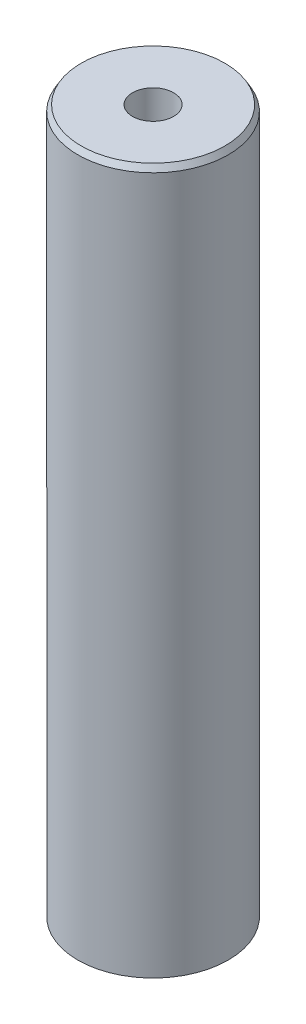
ISO-10303-21;
HEADER;
FILE_DESCRIPTION(('STEP AP214'),'2;1');
FILE_NAME('part.step','',(''),(''),'','','');
FILE_SCHEMA(('AUTOMOTIVE_DESIGN { 1 0 10303 214 1 1 1 1 }'));
ENDSEC;
DATA;
#1=APPLICATION_CONTEXT('core data for automotive mechanical design processes');
#2=APPLICATION_PROTOCOL_DEFINITION('international standard','automotive_design',2000,#1);
#3=PRODUCT_CONTEXT('',#1,'mechanical');
#4=PRODUCT('Part','Part','',(#3));
#5=PRODUCT_RELATED_PRODUCT_CATEGORY('part','',(#4));
#6=PRODUCT_DEFINITION_FORMATION('','',#4);
#7=PRODUCT_DEFINITION_CONTEXT('part definition',#1,'design');
#8=PRODUCT_DEFINITION('design','',#6,#7);
#9=PRODUCT_DEFINITION_SHAPE('','',#8);
#10=(LENGTH_UNIT() NAMED_UNIT(*) SI_UNIT(.MILLI.,.METRE.));
#11=(NAMED_UNIT(*) PLANE_ANGLE_UNIT() SI_UNIT($,.RADIAN.));
#12=(NAMED_UNIT(*) SI_UNIT($,.STERADIAN.) SOLID_ANGLE_UNIT());
#13=UNCERTAINTY_MEASURE_WITH_UNIT(LENGTH_MEASURE(1.E-05),#10,'distance_accuracy_value','');
#14=(GEOMETRIC_REPRESENTATION_CONTEXT(3) GLOBAL_UNCERTAINTY_ASSIGNED_CONTEXT((#13)) GLOBAL_UNIT_ASSIGNED_CONTEXT((#10,
#11,#12)) REPRESENTATION_CONTEXT('',''));
#15=CARTESIAN_POINT('',(0.,0.,0.));
#16=DIRECTION('',(0.,0.,1.));
#17=DIRECTION('',(1.,0.,0.));
#18=AXIS2_PLACEMENT_3D('',#15,#16,#17);
#19=CARTESIAN_POINT('',(0.,164.39141021233,0.));
#20=DIRECTION('',(0.,-1.,0.));
#21=DIRECTION('',(0.,0.,-1.));
#22=AXIS2_PLACEMENT_3D('',#19,#20,#21);
#23=CYLINDRICAL_SURFACE('',#22,17.5);
#24=CARTESIAN_POINT('',(0.,163.011313181697,0.));
#25=DIRECTION('',(0.,1.,0.));
#26=DIRECTION('',(0.,0.,1.));
#27=AXIS2_PLACEMENT_3D('',#24,#25,#26);
#28=CIRCLE('',#27,17.5);
#29=CARTESIAN_POINT('',(0.,163.011313181697,-17.5));
#30=VERTEX_POINT('',#29);
#31=EDGE_CURVE('E50',#30,#30,#28,.F.);
#32=ORIENTED_EDGE('',*,*,#31,.T.);
#33=EDGE_LOOP('',(#32));
#34=FACE_BOUND('',#33,.T.);
#35=CARTESIAN_POINT('',(0.,0.796799392143832,0.));
#36=DIRECTION('',(0.,1.,0.));
#37=DIRECTION('',(0.,0.,1.));
#38=AXIS2_PLACEMENT_3D('',#35,#36,#37);
#39=CIRCLE('',#38,17.5);
#40=CARTESIAN_POINT('',(0.,0.796799392143832,17.5));
#41=VERTEX_POINT('',#40);
#42=EDGE_CURVE('E51',#41,#41,#39,.T.);
#43=ORIENTED_EDGE('',*,*,#42,.T.);
#44=EDGE_LOOP('',(#43));
#45=FACE_BOUND('',#44,.T.);
#46=ADVANCED_FACE('F39',(#34,#45),#23,.T.);
#47=CARTESIAN_POINT('',(0.,164.39141021233,0.));
#48=DIRECTION('',(0.,1.,0.));
#49=DIRECTION('',(0.,0.,1.));
#50=AXIS2_PLACEMENT_3D('',#47,#48,#49);
#51=PLANE('',#50);
#52=CARTESIAN_POINT('',(0.,164.39141021233,0.));
#53=DIRECTION('',(0.,1.,0.));
#54=DIRECTION('',(0.,0.,1.));
#55=AXIS2_PLACEMENT_3D('',#52,#53,#54);
#56=CIRCLE('',#55,16.7032006078562);
#57=CARTESIAN_POINT('',(0.,164.39141021233,-16.7032006078562));
#58=VERTEX_POINT('',#57);
#59=EDGE_CURVE('E54',#58,#58,#56,.T.);
#60=ORIENTED_EDGE('',*,*,#59,.T.);
#61=EDGE_LOOP('',(#60));
#62=FACE_BOUND('',#61,.T.);
#63=CARTESIAN_POINT('',(0.,164.39141021233,0.));
#64=DIRECTION('',(0.,1.,0.));
#65=DIRECTION('',(0.,0.,1.));
#66=AXIS2_PLACEMENT_3D('',#63,#64,#65);
#67=CIRCLE('',#66,4.78098301925172);
#68=CARTESIAN_POINT('',(0.,164.39141021233,4.78098301925172));
#69=VERTEX_POINT('',#68);
#70=EDGE_CURVE('E58',#69,#69,#67,.T.);
#71=ORIENTED_EDGE('',*,*,#70,.F.);
#72=EDGE_LOOP('',(#71));
#73=FACE_BOUND('',#72,.T.);
#74=ADVANCED_FACE('F69',(#62,#73),#51,.T.);
#75=CARTESIAN_POINT('',(0.,0.,0.));
#76=DIRECTION('',(0.,1.,0.));
#77=DIRECTION('',(0.,0.,1.));
#78=AXIS2_PLACEMENT_3D('',#75,#76,#77);
#79=PLANE('',#78);
#80=CARTESIAN_POINT('',(0.,0.,0.));
#81=DIRECTION('',(0.,1.,0.));
#82=DIRECTION('',(0.,0.,1.));
#83=AXIS2_PLACEMENT_3D('',#80,#81,#82);
#84=CIRCLE('',#83,16.1199029693669);
#85=CARTESIAN_POINT('',(0.,0.,16.1199029693669));
#86=VERTEX_POINT('',#85);
#87=EDGE_CURVE('E10',#86,#86,#84,.F.);
#88=ORIENTED_EDGE('',*,*,#87,.T.);
#89=EDGE_LOOP('',(#88));
#90=FACE_BOUND('',#89,.T.);
#91=CARTESIAN_POINT('',(0.,0.,0.));
#92=DIRECTION('',(0.,1.,0.));
#93=DIRECTION('',(0.,0.,1.));
#94=AXIS2_PLACEMENT_3D('',#91,#92,#93);
#95=CIRCLE('',#94,4.78098301925172);
#96=CARTESIAN_POINT('',(0.,0.,4.78098301925172));
#97=VERTEX_POINT('',#96);
#98=EDGE_CURVE('E63',#97,#97,#95,.T.);
#99=ORIENTED_EDGE('',*,*,#98,.T.);
#100=EDGE_LOOP('',(#99));
#101=FACE_BOUND('',#100,.T.);
#102=ADVANCED_FACE('F75',(#90,#101),#79,.F.);
#103=CARTESIAN_POINT('',(0.,164.39141021233,0.));
#104=DIRECTION('',(0.,-1.,0.));
#105=DIRECTION('',(0.,0.,-1.));
#106=AXIS2_PLACEMENT_3D('',#103,#104,#105);
#107=CYLINDRICAL_SURFACE('',#106,4.78098301925172);
#108=ORIENTED_EDGE('',*,*,#70,.T.);
#109=EDGE_LOOP('',(#108));
#110=FACE_BOUND('',#109,.T.);
#111=ORIENTED_EDGE('',*,*,#98,.F.);
#112=EDGE_LOOP('',(#111));
#113=FACE_BOUND('',#112,.T.);
#114=ADVANCED_FACE('F70',(#110,#113),#107,.F.);
#115=CARTESIAN_POINT('',(0.,164.39141021233,0.));
#116=DIRECTION('',(0.,-1.,0.));
#117=DIRECTION('',(0.,0.,-1.));
#118=AXIS2_PLACEMENT_3D('',#115,#116,#117);
#119=CONICAL_SURFACE('',#118,16.7032006078562,0.523598775598286);
#120=CARTESIAN_POINT('',(0.,163.011313181697,-17.5));
#121=CARTESIAN_POINT('',(0.,163.025689192433,-17.4917000063318));
#122=CARTESIAN_POINT('',(0.,163.040065203168,-17.4834000126637));
#123=CARTESIAN_POINT('',(0.,163.06881722464,-17.4668000253274));
#124=CARTESIAN_POINT('',(0.,163.083193235376,-17.4585000316592));
#125=CARTESIAN_POINT('',(0.,163.111945256847,-17.4419000443229));
#126=CARTESIAN_POINT('',(0.,163.126321267583,-17.4336000506547));
#127=CARTESIAN_POINT('',(0.,163.155073289055,-17.4170000633184));
#128=CARTESIAN_POINT('',(0.,163.16944929979,-17.4087000696502));
#129=CARTESIAN_POINT('',(0.,163.198201321262,-17.3921000823139));
#130=CARTESIAN_POINT('',(0.,163.212577331998,-17.3838000886457));
#131=CARTESIAN_POINT('',(0.,163.241329353469,-17.3672001013094));
#132=CARTESIAN_POINT('',(0.,163.255705364205,-17.3589001076412));
#133=CARTESIAN_POINT('',(0.,163.284457385676,-17.3423001203049));
#134=CARTESIAN_POINT('',(0.,163.298833396412,-17.3340001266367));
#135=CARTESIAN_POINT('',(0.,163.327585417884,-17.3174001393004));
#136=CARTESIAN_POINT('',(0.,163.341961428619,-17.3091001456322));
#137=CARTESIAN_POINT('',(0.,163.370713450091,-17.2925001582959));
#138=CARTESIAN_POINT('',(0.,163.385089460827,-17.2842001646277));
#139=CARTESIAN_POINT('',(0.,163.413841482298,-17.2676001772914));
#140=CARTESIAN_POINT('',(0.,163.428217493034,-17.2593001836232));
#141=CARTESIAN_POINT('',(0.,163.456969514506,-17.2427001962869));
#142=CARTESIAN_POINT('',(0.,163.471345525241,-17.2344002026187));
#143=CARTESIAN_POINT('',(0.,163.500097546713,-17.2178002152824));
#144=CARTESIAN_POINT('',(0.,163.514473557449,-17.2095002216142));
#145=CARTESIAN_POINT('',(0.,163.54322557892,-17.1929002342779));
#146=CARTESIAN_POINT('',(0.,163.557601589656,-17.1846002406097));
#147=CARTESIAN_POINT('',(0.,163.586353611127,-17.1680002532734));
#148=CARTESIAN_POINT('',(0.,163.600729621863,-17.1597002596052));
#149=CARTESIAN_POINT('',(0.,163.629481643335,-17.1431002722689));
#150=CARTESIAN_POINT('',(0.,163.64385765407,-17.1348002786008));
#151=CARTESIAN_POINT('',(0.,163.672609675542,-17.1182002912644));
#152=CARTESIAN_POINT('',(0.,163.686985686278,-17.1099002975963));
#153=CARTESIAN_POINT('',(0.,163.715737707749,-17.0933003102599));
#154=CARTESIAN_POINT('',(0.,163.730113718485,-17.0850003165918));
#155=CARTESIAN_POINT('',(0.,163.758865739957,-17.0684003292554));
#156=CARTESIAN_POINT('',(0.,163.773241750692,-17.0601003355873));
#157=CARTESIAN_POINT('',(0.,163.801993772164,-17.0435003482509));
#158=CARTESIAN_POINT('',(0.,163.8163697829,-17.0352003545828));
#159=CARTESIAN_POINT('',(0.,163.845121804371,-17.0186003672464));
#160=CARTESIAN_POINT('',(0.,163.859497815107,-17.0103003735783));
#161=CARTESIAN_POINT('',(0.,163.888249836578,-16.9937003862419));
#162=CARTESIAN_POINT('',(0.,163.902625847314,-16.9854003925738));
#163=CARTESIAN_POINT('',(0.,163.931377868786,-16.9688004052374));
#164=CARTESIAN_POINT('',(0.,163.945753879521,-16.9605004115693));
#165=CARTESIAN_POINT('',(0.,163.974505900993,-16.943900424233));
#166=CARTESIAN_POINT('',(0.,163.988881911729,-16.9356004305648));
#167=CARTESIAN_POINT('',(0.,164.0176339332,-16.9190004432285));
#168=CARTESIAN_POINT('',(0.,164.032009943936,-16.9107004495603));
#169=CARTESIAN_POINT('',(0.,164.060761965408,-16.894100462224));
#170=CARTESIAN_POINT('',(0.,164.075137976143,-16.8858004685558));
#171=CARTESIAN_POINT('',(0.,164.103889997615,-16.8692004812195));
#172=CARTESIAN_POINT('',(0.,164.118266008351,-16.8609004875513));
#173=CARTESIAN_POINT('',(0.,164.147018029822,-16.844300500215));
#174=CARTESIAN_POINT('',(0.,164.161394040558,-16.8360005065468));
#175=CARTESIAN_POINT('',(0.,164.190146062029,-16.8194005192105));
#176=CARTESIAN_POINT('',(0.,164.204522072765,-16.8111005255423));
#177=CARTESIAN_POINT('',(0.,164.233274094237,-16.794500538206));
#178=CARTESIAN_POINT('',(0.,164.247650104972,-16.7862005445378));
#179=CARTESIAN_POINT('',(0.,164.276402126444,-16.7696005572015));
#180=CARTESIAN_POINT('',(0.,164.29077813718,-16.7613005635333));
#181=CARTESIAN_POINT('',(0.,164.319530158651,-16.744700576197));
#182=CARTESIAN_POINT('',(0.,164.333906169387,-16.7364005825288));
#183=CARTESIAN_POINT('',(0.,164.362658190859,-16.7198005951925));
#184=CARTESIAN_POINT('',(0.,164.377034201594,-16.7115006015243));
#185=CARTESIAN_POINT('',(0.,164.39141021233,-16.7032006078562));
#186=B_SPLINE_CURVE_WITH_KNOTS('',3,(#120,#121,#122,#123,#124,#125,#126,#127,#128,#129,#130,
#131,#132,#133,#134,#135,#136,#137,#138,#139,#140,#141,#142,#143,#144,#145,#146,#147,#148,#149,
#150,#151,#152,#153,#154,#155,#156,#157,#158,#159,#160,#161,#162,#163,#164,#165,#166,#167,#168,
#169,#170,#171,#172,#173,#174,#175,#176,#177,#178,#179,#180,#181,#182,#183,#184,#185),
.UNSPECIFIED.,.F.,.F.,(4,2,2,2,2,2,2,2,2,2,2,2,2,2,2,2,2,2,2,2,2,2,2,2,2,2,2,2,2,2,2,2,4),(0.,
0.049799962008999,0.0995999240179979,0.149399886026997,0.199199848035972,0.248999810044971,
0.298799772053972,0.348599734062946,0.398399696071945,0.448199658080944,0.497999620089919,
0.547799582098918,0.597599544107919,0.647399506116894,0.697199468125893,0.746999430134892,
0.796799392143867,0.846599354152866,0.896399316161865,0.946199278170865,0.99599924017984,
1.04579920218884,1.09559916419784,1.14539912620681,1.19519908821581,1.24499905022481,
1.29479901223379,1.34459897424279,1.39439893625179,1.44419889826076,1.49399886026976,
1.54379882227876,1.59359878428776),.UNSPECIFIED.);
#187=EDGE_CURVE('BSEAM81',#30,#58,#186,.T.);
#188=ORIENTED_EDGE('',*,*,#31,.F.);
#189=ORIENTED_EDGE('',*,*,#59,.F.);
#190=ORIENTED_EDGE('',*,*,#187,.T.);
#191=ORIENTED_EDGE('',*,*,#187,.F.);
#192=EDGE_LOOP('',(#188,#190,#189,#191));
#193=FACE_BOUND('',#192,.T.);
#194=ADVANCED_FACE('F81',(#193),#119,.T.);
#195=CARTESIAN_POINT('',(0.,0.796799392143832,0.));
#196=DIRECTION('',(0.,1.,0.));
#197=DIRECTION('',(0.,0.,1.));
#198=AXIS2_PLACEMENT_3D('',#195,#196,#197);
#199=CONICAL_SURFACE('',#198,17.5,1.0471975511966);
#200=ORIENTED_EDGE('',*,*,#87,.F.);
#201=EDGE_LOOP('',(#200));
#202=FACE_BOUND('',#201,.T.);
#203=ORIENTED_EDGE('',*,*,#42,.F.);
#204=EDGE_LOOP('',(#203));
#205=FACE_BOUND('',#204,.T.);
#206=ADVANCED_FACE('F45',(#202,#205),#199,.T.);
#207=CLOSED_SHELL('',(#46,#74,#102,#114,#194,#206));
#208=MANIFOLD_SOLID_BREP('B2',#207);
#209=ADVANCED_BREP_SHAPE_REPRESENTATION('',(#18,#208),#14);
#210=SHAPE_DEFINITION_REPRESENTATION(#9,#209);
ENDSEC;
END-ISO-10303-21;
